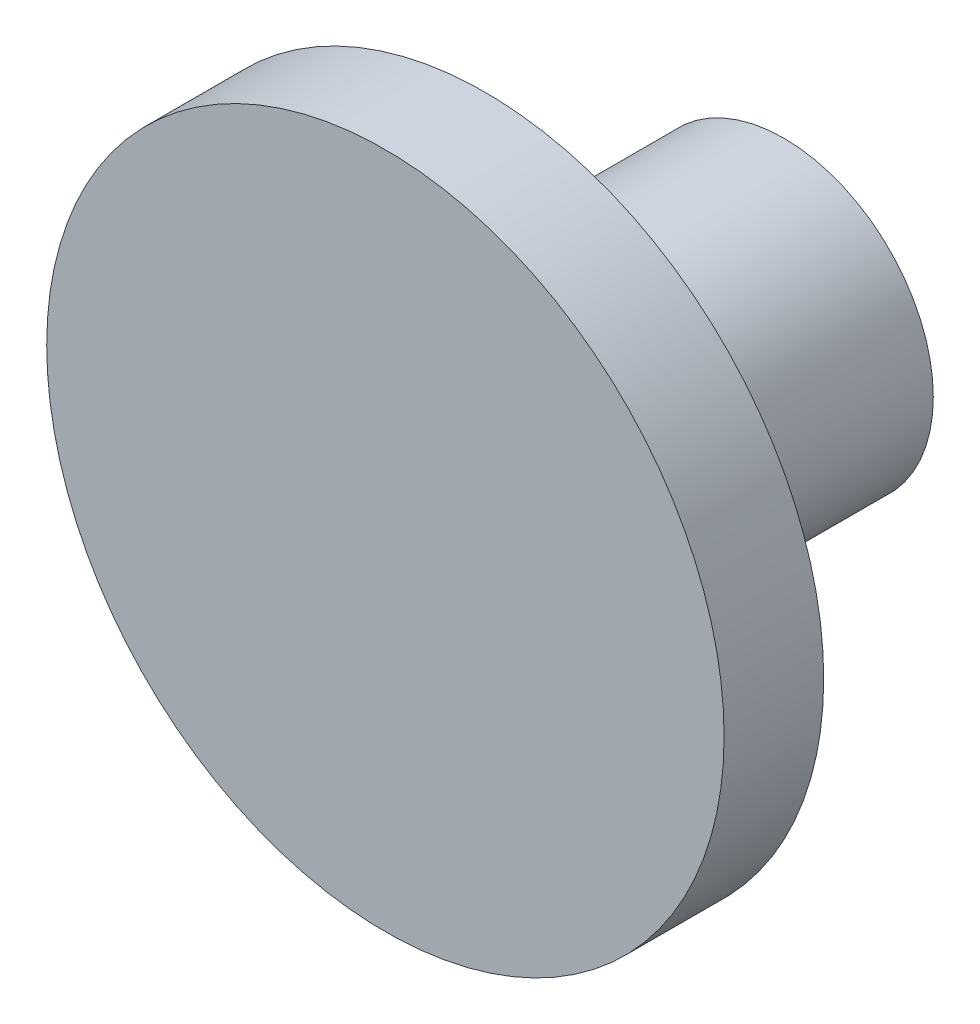
ISO-10303-21;
HEADER;
FILE_DESCRIPTION(('STEP AP214'),'2;1');
FILE_NAME('part.step','',(''),(''),'','','');
FILE_SCHEMA(('AUTOMOTIVE_DESIGN { 1 0 10303 214 1 1 1 1 }'));
ENDSEC;
DATA;
#1=APPLICATION_CONTEXT('core data for automotive mechanical design processes');
#2=APPLICATION_PROTOCOL_DEFINITION('international standard','automotive_design',2000,#1);
#3=PRODUCT_CONTEXT('',#1,'mechanical');
#4=PRODUCT('Part','Part','',(#3));
#5=PRODUCT_RELATED_PRODUCT_CATEGORY('part','',(#4));
#6=PRODUCT_DEFINITION_FORMATION('','',#4);
#7=PRODUCT_DEFINITION_CONTEXT('part definition',#1,'design');
#8=PRODUCT_DEFINITION('design','',#6,#7);
#9=PRODUCT_DEFINITION_SHAPE('','',#8);
#10=(LENGTH_UNIT() NAMED_UNIT(*) SI_UNIT(.MILLI.,.METRE.));
#11=(NAMED_UNIT(*) PLANE_ANGLE_UNIT() SI_UNIT($,.RADIAN.));
#12=(NAMED_UNIT(*) SI_UNIT($,.STERADIAN.) SOLID_ANGLE_UNIT());
#13=UNCERTAINTY_MEASURE_WITH_UNIT(LENGTH_MEASURE(1.E-05),#10,'distance_accuracy_value','');
#14=(GEOMETRIC_REPRESENTATION_CONTEXT(3) GLOBAL_UNCERTAINTY_ASSIGNED_CONTEXT((#13)) GLOBAL_UNIT_ASSIGNED_CONTEXT((#10,
#11,#12)) REPRESENTATION_CONTEXT('',''));
#15=CARTESIAN_POINT('',(0.,0.,0.));
#16=DIRECTION('',(0.,0.,1.));
#17=DIRECTION('',(1.,0.,0.));
#18=AXIS2_PLACEMENT_3D('',#15,#16,#17);
#19=CARTESIAN_POINT('',(0.,4.99999999999998,0.));
#20=DIRECTION('',(0.,0.,1.));
#21=DIRECTION('',(1.,0.,0.));
#22=AXIS2_PLACEMENT_3D('',#19,#20,#21);
#23=PLANE('',#22);
#24=CARTESIAN_POINT('',(0.,4.99999999999998,0.));
#25=DIRECTION('',(0.,0.,1.));
#26=DIRECTION('',(1.,0.,0.));
#27=AXIS2_PLACEMENT_3D('',#24,#25,#26);
#28=CIRCLE('',#27,1.5);
#29=CARTESIAN_POINT('',(1.5,4.99999999999998,0.));
#30=VERTEX_POINT('',#29);
#31=EDGE_CURVE('E10',#30,#30,#28,.T.);
#32=ORIENTED_EDGE('',*,*,#31,.F.);
#33=EDGE_LOOP('',(#32));
#34=FACE_BOUND('',#33,.T.);
#35=ADVANCED_FACE('F32',(#34),#23,.F.);
#36=CARTESIAN_POINT('',(0.,4.99999999999998,8.24264068711929));
#37=DIRECTION('',(0.,0.,-1.));
#38=DIRECTION('',(-1.,0.,0.));
#39=AXIS2_PLACEMENT_3D('',#36,#37,#38);
#40=CYLINDRICAL_SURFACE('',#39,1.5);
#41=CARTESIAN_POINT('',(0.,4.99999999999998,3.00000000000001));
#42=DIRECTION('',(0.,0.,-1.));
#43=DIRECTION('',(-1.,0.,0.));
#44=AXIS2_PLACEMENT_3D('',#41,#42,#43);
#45=CIRCLE('',#44,1.5);
#46=CARTESIAN_POINT('',(-1.5,4.99999999999998,3.00000000000001));
#47=VERTEX_POINT('',#46);
#48=EDGE_CURVE('E36',#47,#47,#45,.T.);
#49=ORIENTED_EDGE('',*,*,#48,.T.);
#50=EDGE_LOOP('',(#49));
#51=FACE_BOUND('',#50,.T.);
#52=ORIENTED_EDGE('',*,*,#31,.T.);
#53=EDGE_LOOP('',(#52));
#54=FACE_BOUND('',#53,.T.);
#55=ADVANCED_FACE('F34',(#51,#54),#40,.T.);
#56=CARTESIAN_POINT('',(0.,5.00000000000001,3.00000000000001));
#57=DIRECTION('',(0.,0.,1.));
#58=DIRECTION('',(1.,0.,0.));
#59=AXIS2_PLACEMENT_3D('',#56,#57,#58);
#60=CYLINDRICAL_SURFACE('',#59,3.4);
#61=CARTESIAN_POINT('',(0.,5.00000000000001,3.00000000000001));
#62=DIRECTION('',(0.,0.,-1.));
#63=DIRECTION('',(-1.,0.,0.));
#64=AXIS2_PLACEMENT_3D('',#61,#62,#63);
#65=CIRCLE('',#64,3.4);
#66=CARTESIAN_POINT('',(-3.4,5.00000000000001,3.00000000000001));
#67=VERTEX_POINT('',#66);
#68=EDGE_CURVE('E43',#67,#67,#65,.T.);
#69=ORIENTED_EDGE('',*,*,#68,.F.);
#70=EDGE_LOOP('',(#69));
#71=FACE_BOUND('',#70,.T.);
#72=CARTESIAN_POINT('',(0.,5.00000000000001,4.00000000000001));
#73=DIRECTION('',(0.,0.,-1.));
#74=DIRECTION('',(-1.,0.,0.));
#75=AXIS2_PLACEMENT_3D('',#72,#73,#74);
#76=CIRCLE('',#75,3.4);
#77=CARTESIAN_POINT('',(-3.4,5.00000000000001,4.00000000000001));
#78=VERTEX_POINT('',#77);
#79=EDGE_CURVE('E45',#78,#78,#76,.T.);
#80=ORIENTED_EDGE('',*,*,#79,.T.);
#81=EDGE_LOOP('',(#80));
#82=FACE_BOUND('',#81,.T.);
#83=ADVANCED_FACE('F53',(#71,#82),#60,.T.);
#84=CARTESIAN_POINT('',(0.,5.00000000000001,3.00000000000001));
#85=DIRECTION('',(0.,0.,-1.));
#86=DIRECTION('',(-1.,0.,0.));
#87=AXIS2_PLACEMENT_3D('',#84,#85,#86);
#88=PLANE('',#87);
#89=ORIENTED_EDGE('',*,*,#48,.F.);
#90=EDGE_LOOP('',(#89));
#91=FACE_BOUND('',#90,.T.);
#92=ORIENTED_EDGE('',*,*,#68,.T.);
#93=EDGE_LOOP('',(#92));
#94=FACE_BOUND('',#93,.T.);
#95=ADVANCED_FACE('F51',(#91,#94),#88,.T.);
#96=CARTESIAN_POINT('',(7.32817162390823,6.81670048454506,4.00000000000001));
#97=DIRECTION('',(0.,0.,-1.));
#98=DIRECTION('',(-0.240622580734445,0.97061875813354,0.));
#99=AXIS2_PLACEMENT_3D('',#96,#97,#98);
#100=PLANE('',#99);
#101=ORIENTED_EDGE('',*,*,#79,.F.);
#102=EDGE_LOOP('',(#101));
#103=FACE_BOUND('',#102,.T.);
#104=ADVANCED_FACE('F59',(#103),#100,.F.);
#105=CLOSED_SHELL('',(#35,#55,#83,#95,#104));
#106=MANIFOLD_SOLID_BREP('B2',#105);
#107=ADVANCED_BREP_SHAPE_REPRESENTATION('',(#18,#106),#14);
#108=SHAPE_DEFINITION_REPRESENTATION(#9,#107);
ENDSEC;
END-ISO-10303-21;
